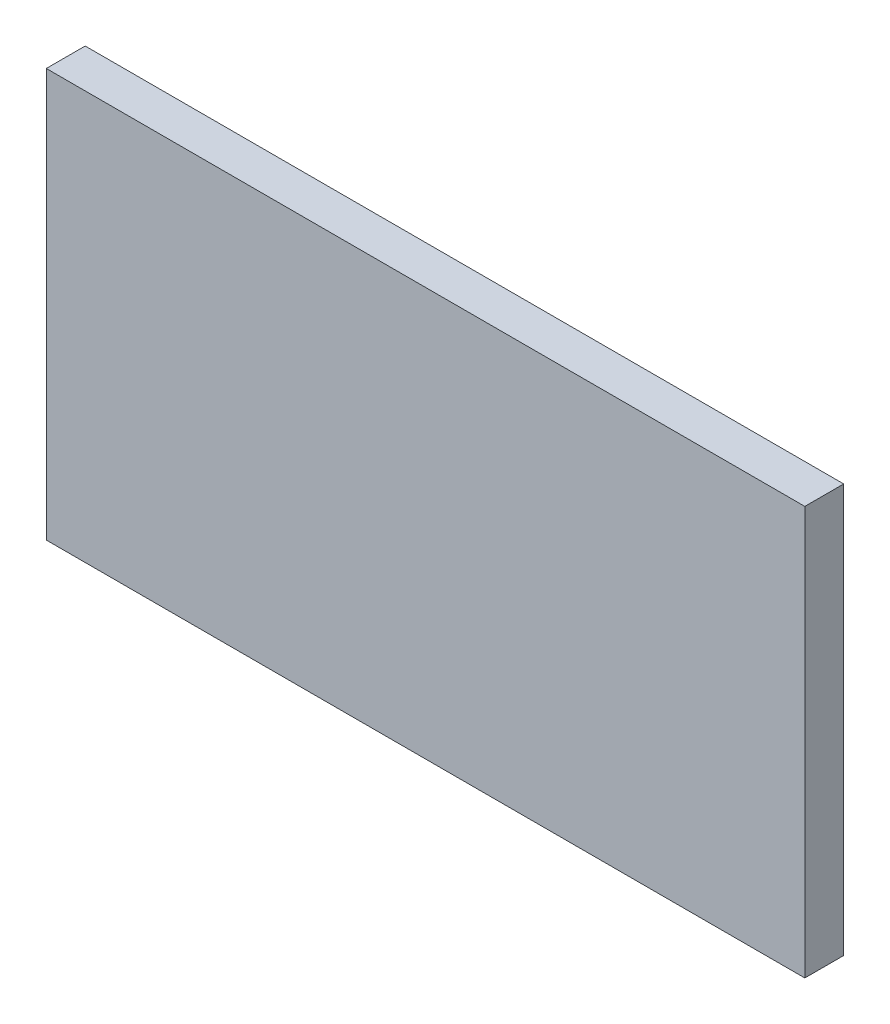
ISO-10303-21;
HEADER;
FILE_DESCRIPTION(('STEP AP214'),'2;1');
FILE_NAME('part.step','',(''),(''),'','','');
FILE_SCHEMA(('AUTOMOTIVE_DESIGN { 1 0 10303 214 1 1 1 1 }'));
ENDSEC;
DATA;
#1=APPLICATION_CONTEXT('core data for automotive mechanical design processes');
#2=APPLICATION_PROTOCOL_DEFINITION('international standard','automotive_design',2000,#1);
#3=PRODUCT_CONTEXT('',#1,'mechanical');
#4=PRODUCT('Part','Part','',(#3));
#5=PRODUCT_RELATED_PRODUCT_CATEGORY('part','',(#4));
#6=PRODUCT_DEFINITION_FORMATION('','',#4);
#7=PRODUCT_DEFINITION_CONTEXT('part definition',#1,'design');
#8=PRODUCT_DEFINITION('design','',#6,#7);
#9=PRODUCT_DEFINITION_SHAPE('','',#8);
#10=(LENGTH_UNIT() NAMED_UNIT(*) SI_UNIT(.MILLI.,.METRE.));
#11=(NAMED_UNIT(*) PLANE_ANGLE_UNIT() SI_UNIT($,.RADIAN.));
#12=(NAMED_UNIT(*) SI_UNIT($,.STERADIAN.) SOLID_ANGLE_UNIT());
#13=UNCERTAINTY_MEASURE_WITH_UNIT(LENGTH_MEASURE(1.E-05),#10,'distance_accuracy_value','');
#14=(GEOMETRIC_REPRESENTATION_CONTEXT(3) GLOBAL_UNCERTAINTY_ASSIGNED_CONTEXT((#13)) GLOBAL_UNIT_ASSIGNED_CONTEXT((#10,
#11,#12)) REPRESENTATION_CONTEXT('',''));
#15=CARTESIAN_POINT('',(0.,0.,0.));
#16=DIRECTION('',(0.,0.,1.));
#17=DIRECTION('',(1.,0.,0.));
#18=AXIS2_PLACEMENT_3D('',#15,#16,#17);
#19=CARTESIAN_POINT('',(-50.8,31.75,6.35));
#20=DIRECTION('',(1.,0.,0.));
#21=DIRECTION('',(0.,1.,0.));
#22=AXIS2_PLACEMENT_3D('',#19,#20,#21);
#23=PLANE('',#22);
#24=DIRECTION('',(0.,-1.,0.));
#25=VECTOR('',#24,1.);
#26=CARTESIAN_POINT('',(-50.8,31.75,0.));
#27=LINE('',#26,#25);
#28=CARTESIAN_POINT('',(-50.8,31.75,0.));
#29=VERTEX_POINT('',#28);
#30=CARTESIAN_POINT('',(-50.8,-34.925,0.));
#31=VERTEX_POINT('',#30);
#32=EDGE_CURVE('E96',#29,#31,#27,.T.);
#33=ORIENTED_EDGE('',*,*,#32,.T.);
#34=DIRECTION('',(0.,0.,-1.));
#35=VECTOR('',#34,1.);
#36=CARTESIAN_POINT('',(-50.8,-34.925,6.35));
#37=LINE('',#36,#35);
#38=CARTESIAN_POINT('',(-50.8,-34.925,6.35));
#39=VERTEX_POINT('',#38);
#40=EDGE_CURVE('E11',#39,#31,#37,.T.);
#41=ORIENTED_EDGE('',*,*,#40,.F.);
#42=DIRECTION('',(0.,-1.,0.));
#43=VECTOR('',#42,1.);
#44=CARTESIAN_POINT('',(-50.8,31.75,6.35));
#45=LINE('',#44,#43);
#46=CARTESIAN_POINT('',(-50.8,31.75,6.35));
#47=VERTEX_POINT('',#46);
#48=EDGE_CURVE('E84',#47,#39,#45,.T.);
#49=ORIENTED_EDGE('',*,*,#48,.F.);
#50=DIRECTION('',(0.,0.,-1.));
#51=VECTOR('',#50,1.);
#52=CARTESIAN_POINT('',(-50.8,31.75,6.35));
#53=LINE('',#52,#51);
#54=EDGE_CURVE('E92',#47,#29,#53,.T.);
#55=ORIENTED_EDGE('',*,*,#54,.T.);
#56=EDGE_LOOP('',(#33,#41,#49,#55));
#57=FACE_BOUND('',#56,.T.);
#58=ADVANCED_FACE('F33',(#57),#23,.F.);
#59=CARTESIAN_POINT('',(-50.8,-34.925,6.35));
#60=DIRECTION('',(0.,1.,0.));
#61=DIRECTION('',(-1.,0.,0.));
#62=AXIS2_PLACEMENT_3D('',#59,#60,#61);
#63=PLANE('',#62);
#64=DIRECTION('',(1.,0.,0.));
#65=VECTOR('',#64,1.);
#66=CARTESIAN_POINT('',(-50.8,-34.925,0.));
#67=LINE('',#66,#65);
#68=CARTESIAN_POINT('',(73.025,-34.925,0.));
#69=VERTEX_POINT('',#68);
#70=EDGE_CURVE('E88',#31,#69,#67,.T.);
#71=ORIENTED_EDGE('',*,*,#70,.T.);
#72=DIRECTION('',(0.,0.,-1.));
#73=VECTOR('',#72,1.);
#74=CARTESIAN_POINT('',(73.025,-34.925,6.35));
#75=LINE('',#74,#73);
#76=CARTESIAN_POINT('',(73.025,-34.925,6.35));
#77=VERTEX_POINT('',#76);
#78=EDGE_CURVE('E41',#77,#69,#75,.T.);
#79=ORIENTED_EDGE('',*,*,#78,.F.);
#80=DIRECTION('',(1.,0.,0.));
#81=VECTOR('',#80,1.);
#82=CARTESIAN_POINT('',(-50.8,-34.925,6.35));
#83=LINE('',#82,#81);
#84=EDGE_CURVE('E79',#39,#77,#83,.T.);
#85=ORIENTED_EDGE('',*,*,#84,.F.);
#86=ORIENTED_EDGE('',*,*,#40,.T.);
#87=EDGE_LOOP('',(#71,#79,#85,#86));
#88=FACE_BOUND('',#87,.T.);
#89=ADVANCED_FACE('F87',(#88),#63,.F.);
#90=CARTESIAN_POINT('',(73.025,31.75,6.35));
#91=DIRECTION('',(-1.,0.,0.));
#92=DIRECTION('',(0.,-1.,0.));
#93=AXIS2_PLACEMENT_3D('',#90,#91,#92);
#94=PLANE('',#93);
#95=DIRECTION('',(0.,1.,0.));
#96=VECTOR('',#95,1.);
#97=CARTESIAN_POINT('',(73.025,31.75,0.));
#98=LINE('',#97,#96);
#99=CARTESIAN_POINT('',(73.025,31.75,0.));
#100=VERTEX_POINT('',#99);
#101=EDGE_CURVE('E66',#69,#100,#98,.T.);
#102=ORIENTED_EDGE('',*,*,#101,.T.);
#103=DIRECTION('',(0.,0.,-1.));
#104=VECTOR('',#103,1.);
#105=CARTESIAN_POINT('',(73.025,31.75,6.35));
#106=LINE('',#105,#104);
#107=CARTESIAN_POINT('',(73.025,31.75,6.35));
#108=VERTEX_POINT('',#107);
#109=EDGE_CURVE('E89',#108,#100,#106,.T.);
#110=ORIENTED_EDGE('',*,*,#109,.F.);
#111=DIRECTION('',(0.,1.,0.));
#112=VECTOR('',#111,1.);
#113=CARTESIAN_POINT('',(73.025,31.75,6.35));
#114=LINE('',#113,#112);
#115=EDGE_CURVE('E82',#77,#108,#114,.T.);
#116=ORIENTED_EDGE('',*,*,#115,.F.);
#117=ORIENTED_EDGE('',*,*,#78,.T.);
#118=EDGE_LOOP('',(#102,#110,#116,#117));
#119=FACE_BOUND('',#118,.T.);
#120=ADVANCED_FACE('F90',(#119),#94,.F.);
#121=CARTESIAN_POINT('',(-50.8,31.75,6.35));
#122=DIRECTION('',(0.,-1.,0.));
#123=DIRECTION('',(0.,0.,-1.));
#124=AXIS2_PLACEMENT_3D('',#121,#122,#123);
#125=PLANE('',#124);
#126=DIRECTION('',(-1.,0.,0.));
#127=VECTOR('',#126,1.);
#128=CARTESIAN_POINT('',(-50.8,31.75,0.));
#129=LINE('',#128,#127);
#130=EDGE_CURVE('E72',#100,#29,#129,.T.);
#131=ORIENTED_EDGE('',*,*,#130,.T.);
#132=ORIENTED_EDGE('',*,*,#54,.F.);
#133=DIRECTION('',(-1.,0.,0.));
#134=VECTOR('',#133,1.);
#135=CARTESIAN_POINT('',(-50.8,31.75,6.35));
#136=LINE('',#135,#134);
#137=EDGE_CURVE('E49',#108,#47,#136,.T.);
#138=ORIENTED_EDGE('',*,*,#137,.F.);
#139=ORIENTED_EDGE('',*,*,#109,.T.);
#140=EDGE_LOOP('',(#131,#132,#138,#139));
#141=FACE_BOUND('',#140,.T.);
#142=ADVANCED_FACE('F103',(#141),#125,.F.);
#143=CARTESIAN_POINT('',(0.,0.,6.35));
#144=DIRECTION('',(0.,0.,1.));
#145=DIRECTION('',(1.,0.,0.));
#146=AXIS2_PLACEMENT_3D('',#143,#144,#145);
#147=PLANE('',#146);
#148=ORIENTED_EDGE('',*,*,#48,.T.);
#149=ORIENTED_EDGE('',*,*,#84,.T.);
#150=ORIENTED_EDGE('',*,*,#115,.T.);
#151=ORIENTED_EDGE('',*,*,#137,.T.);
#152=EDGE_LOOP('',(#148,#149,#150,#151));
#153=FACE_BOUND('',#152,.T.);
#154=ADVANCED_FACE('F80',(#153),#147,.T.);
#155=CARTESIAN_POINT('',(0.,0.,0.));
#156=DIRECTION('',(0.,0.,1.));
#157=DIRECTION('',(1.,0.,0.));
#158=AXIS2_PLACEMENT_3D('',#155,#156,#157);
#159=PLANE('',#158);
#160=ORIENTED_EDGE('',*,*,#32,.F.);
#161=ORIENTED_EDGE('',*,*,#130,.F.);
#162=ORIENTED_EDGE('',*,*,#101,.F.);
#163=ORIENTED_EDGE('',*,*,#70,.F.);
#164=EDGE_LOOP('',(#160,#161,#162,#163));
#165=FACE_BOUND('',#164,.T.);
#166=ADVANCED_FACE('F106',(#165),#159,.F.);
#167=CLOSED_SHELL('',(#58,#89,#120,#142,#154,#166));
#168=MANIFOLD_SOLID_BREP('B2',#167);
#169=ADVANCED_BREP_SHAPE_REPRESENTATION('',(#18,#168),#14);
#170=SHAPE_DEFINITION_REPRESENTATION(#9,#169);
ENDSEC;
END-ISO-10303-21;
